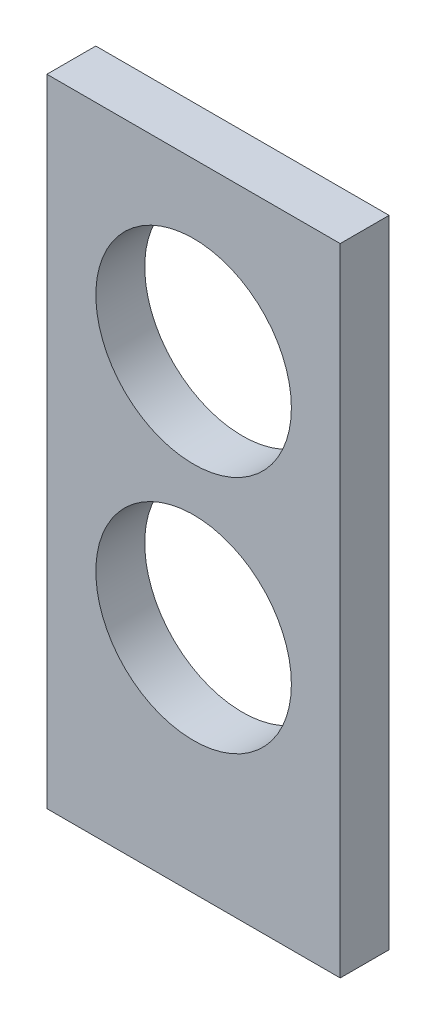
ISO-10303-21;
HEADER;
FILE_DESCRIPTION(('STEP AP214'),'2;1');
FILE_NAME('part.step','',(''),(''),'','','');
FILE_SCHEMA(('AUTOMOTIVE_DESIGN { 1 0 10303 214 1 1 1 1 }'));
ENDSEC;
DATA;
#1=APPLICATION_CONTEXT('core data for automotive mechanical design processes');
#2=APPLICATION_PROTOCOL_DEFINITION('international standard','automotive_design',2000,#1);
#3=PRODUCT_CONTEXT('',#1,'mechanical');
#4=PRODUCT('Part','Part','',(#3));
#5=PRODUCT_RELATED_PRODUCT_CATEGORY('part','',(#4));
#6=PRODUCT_DEFINITION_FORMATION('','',#4);
#7=PRODUCT_DEFINITION_CONTEXT('part definition',#1,'design');
#8=PRODUCT_DEFINITION('design','',#6,#7);
#9=PRODUCT_DEFINITION_SHAPE('','',#8);
#10=(LENGTH_UNIT() NAMED_UNIT(*) SI_UNIT(.MILLI.,.METRE.));
#11=(NAMED_UNIT(*) PLANE_ANGLE_UNIT() SI_UNIT($,.RADIAN.));
#12=(NAMED_UNIT(*) SI_UNIT($,.STERADIAN.) SOLID_ANGLE_UNIT());
#13=UNCERTAINTY_MEASURE_WITH_UNIT(LENGTH_MEASURE(1.E-05),#10,'distance_accuracy_value','');
#14=(GEOMETRIC_REPRESENTATION_CONTEXT(3) GLOBAL_UNCERTAINTY_ASSIGNED_CONTEXT((#13)) GLOBAL_UNIT_ASSIGNED_CONTEXT((#10,
#11,#12)) REPRESENTATION_CONTEXT('',''));
#15=CARTESIAN_POINT('',(0.,0.,0.));
#16=DIRECTION('',(0.,0.,1.));
#17=DIRECTION('',(1.,0.,0.));
#18=AXIS2_PLACEMENT_3D('',#15,#16,#17);
#19=CARTESIAN_POINT('',(0.,0.,5.));
#20=DIRECTION('',(0.,0.,-1.));
#21=DIRECTION('',(-1.,0.,0.));
#22=AXIS2_PLACEMENT_3D('',#19,#20,#21);
#23=PLANE('',#22);
#24=DIRECTION('',(1.,0.,0.));
#25=VECTOR('',#24,1.);
#26=CARTESIAN_POINT('',(-15.0054931684976,-40.5861330056473,5.));
#27=LINE('',#26,#25);
#28=CARTESIAN_POINT('',(-15.0054931684976,-40.5861330056473,5.));
#29=VERTEX_POINT('',#28);
#30=CARTESIAN_POINT('',(14.9945068315024,-40.5861330056473,5.));
#31=VERTEX_POINT('',#30);
#32=EDGE_CURVE('E85',#29,#31,#27,.T.);
#33=ORIENTED_EDGE('',*,*,#32,.T.);
#34=DIRECTION('',(0.,1.,0.));
#35=VECTOR('',#34,1.);
#36=CARTESIAN_POINT('',(14.9945068315024,24.4701594620561,5.));
#37=LINE('',#36,#35);
#38=CARTESIAN_POINT('',(14.9945068315024,24.4701594620561,5.));
#39=VERTEX_POINT('',#38);
#40=EDGE_CURVE('E80',#31,#39,#37,.T.);
#41=ORIENTED_EDGE('',*,*,#40,.T.);
#42=DIRECTION('',(-1.,0.,0.));
#43=VECTOR('',#42,1.);
#44=CARTESIAN_POINT('',(-15.0054931684976,24.4701594620561,5.));
#45=LINE('',#44,#43);
#46=CARTESIAN_POINT('',(-15.0054931684976,24.4701594620561,5.));
#47=VERTEX_POINT('',#46);
#48=EDGE_CURVE('E83',#39,#47,#45,.T.);
#49=ORIENTED_EDGE('',*,*,#48,.T.);
#50=DIRECTION('',(0.,-1.,0.));
#51=VECTOR('',#50,1.);
#52=CARTESIAN_POINT('',(-15.0054931684976,-40.5861330056473,5.));
#53=LINE('',#52,#51);
#54=EDGE_CURVE('E50',#47,#29,#53,.T.);
#55=ORIENTED_EDGE('',*,*,#54,.T.);
#56=EDGE_LOOP('',(#33,#41,#49,#55));
#57=FACE_BOUND('',#56,.T.);
#58=CARTESIAN_POINT('',(0.,7.4227519636605,5.));
#59=DIRECTION('',(0.,0.,1.));
#60=DIRECTION('',(1.,0.,0.));
#61=AXIS2_PLACEMENT_3D('',#58,#59,#60);
#62=CIRCLE('',#61,10.);
#63=CARTESIAN_POINT('',(10.,7.4227519636605,5.));
#64=VERTEX_POINT('',#63);
#65=EDGE_CURVE('E100',#64,#64,#62,.T.);
#66=ORIENTED_EDGE('',*,*,#65,.F.);
#67=EDGE_LOOP('',(#66));
#68=FACE_BOUND('',#67,.T.);
#69=CARTESIAN_POINT('',(0.,-17.0544659184068,5.));
#70=DIRECTION('',(0.,0.,1.));
#71=DIRECTION('',(1.,0.,0.));
#72=AXIS2_PLACEMENT_3D('',#69,#70,#71);
#73=CIRCLE('',#72,10.);
#74=CARTESIAN_POINT('',(9.99999999999999,-17.0544659184068,5.));
#75=VERTEX_POINT('',#74);
#76=EDGE_CURVE('E115',#75,#75,#73,.T.);
#77=ORIENTED_EDGE('',*,*,#76,.F.);
#78=EDGE_LOOP('',(#77));
#79=FACE_BOUND('',#78,.T.);
#80=ADVANCED_FACE('F33',(#57,#68,#79),#23,.F.);
#81=CARTESIAN_POINT('',(0.,0.,0.));
#82=DIRECTION('',(0.,0.,-1.));
#83=DIRECTION('',(-1.,0.,0.));
#84=AXIS2_PLACEMENT_3D('',#81,#82,#83);
#85=PLANE('',#84);
#86=CARTESIAN_POINT('',(0.,7.4227519636605,0.));
#87=DIRECTION('',(0.,0.,1.));
#88=DIRECTION('',(1.,0.,0.));
#89=AXIS2_PLACEMENT_3D('',#86,#87,#88);
#90=CIRCLE('',#89,10.);
#91=CARTESIAN_POINT('',(10.,7.4227519636605,0.));
#92=VERTEX_POINT('',#91);
#93=EDGE_CURVE('E112',#92,#92,#90,.T.);
#94=ORIENTED_EDGE('',*,*,#93,.T.);
#95=EDGE_LOOP('',(#94));
#96=FACE_BOUND('',#95,.T.);
#97=DIRECTION('',(1.,0.,0.));
#98=VECTOR('',#97,1.);
#99=CARTESIAN_POINT('',(-15.0054931684976,-40.5861330056473,0.));
#100=LINE('',#99,#98);
#101=CARTESIAN_POINT('',(-15.0054931684976,-40.5861330056473,0.));
#102=VERTEX_POINT('',#101);
#103=CARTESIAN_POINT('',(14.9945068315024,-40.5861330056473,0.));
#104=VERTEX_POINT('',#103);
#105=EDGE_CURVE('E97',#102,#104,#100,.T.);
#106=ORIENTED_EDGE('',*,*,#105,.F.);
#107=DIRECTION('',(0.,-1.,0.));
#108=VECTOR('',#107,1.);
#109=CARTESIAN_POINT('',(-15.0054931684976,-40.5861330056473,0.));
#110=LINE('',#109,#108);
#111=CARTESIAN_POINT('',(-15.0054931684976,24.4701594620561,0.));
#112=VERTEX_POINT('',#111);
#113=EDGE_CURVE('E73',#112,#102,#110,.T.);
#114=ORIENTED_EDGE('',*,*,#113,.F.);
#115=DIRECTION('',(-1.,0.,0.));
#116=VECTOR('',#115,1.);
#117=CARTESIAN_POINT('',(-15.0054931684976,24.4701594620561,0.));
#118=LINE('',#117,#116);
#119=CARTESIAN_POINT('',(14.9945068315024,24.4701594620561,0.));
#120=VERTEX_POINT('',#119);
#121=EDGE_CURVE('E67',#120,#112,#118,.T.);
#122=ORIENTED_EDGE('',*,*,#121,.F.);
#123=DIRECTION('',(0.,1.,0.));
#124=VECTOR('',#123,1.);
#125=CARTESIAN_POINT('',(14.9945068315024,24.4701594620561,0.));
#126=LINE('',#125,#124);
#127=EDGE_CURVE('E89',#104,#120,#126,.T.);
#128=ORIENTED_EDGE('',*,*,#127,.F.);
#129=EDGE_LOOP('',(#106,#114,#122,#128));
#130=FACE_BOUND('',#129,.T.);
#131=CARTESIAN_POINT('',(0.,-17.0544659184068,0.));
#132=DIRECTION('',(0.,0.,1.));
#133=DIRECTION('',(1.,0.,0.));
#134=AXIS2_PLACEMENT_3D('',#131,#132,#133);
#135=CIRCLE('',#134,10.);
#136=CARTESIAN_POINT('',(9.99999999999999,-17.0544659184068,0.));
#137=VERTEX_POINT('',#136);
#138=EDGE_CURVE('E118',#137,#137,#135,.T.);
#139=ORIENTED_EDGE('',*,*,#138,.T.);
#140=EDGE_LOOP('',(#139));
#141=FACE_BOUND('',#140,.T.);
#142=ADVANCED_FACE('F108',(#96,#130,#141),#85,.T.);
#143=CARTESIAN_POINT('',(-15.0054931684976,-40.5861330056473,5.));
#144=DIRECTION('',(0.,1.,0.));
#145=DIRECTION('',(0.,0.,1.));
#146=AXIS2_PLACEMENT_3D('',#143,#144,#145);
#147=PLANE('',#146);
#148=ORIENTED_EDGE('',*,*,#105,.T.);
#149=DIRECTION('',(0.,0.,-1.));
#150=VECTOR('',#149,1.);
#151=CARTESIAN_POINT('',(14.9945068315024,-40.5861330056473,5.));
#152=LINE('',#151,#150);
#153=EDGE_CURVE('E11',#31,#104,#152,.T.);
#154=ORIENTED_EDGE('',*,*,#153,.F.);
#155=ORIENTED_EDGE('',*,*,#32,.F.);
#156=DIRECTION('',(0.,0.,-1.));
#157=VECTOR('',#156,1.);
#158=CARTESIAN_POINT('',(-15.0054931684976,-40.5861330056473,5.));
#159=LINE('',#158,#157);
#160=EDGE_CURVE('E93',#29,#102,#159,.T.);
#161=ORIENTED_EDGE('',*,*,#160,.T.);
#162=EDGE_LOOP('',(#148,#154,#155,#161));
#163=FACE_BOUND('',#162,.T.);
#164=ADVANCED_FACE('F35',(#163),#147,.F.);
#165=CARTESIAN_POINT('',(14.9945068315024,24.4701594620561,5.));
#166=DIRECTION('',(-1.,0.,0.));
#167=DIRECTION('',(0.,-1.,0.));
#168=AXIS2_PLACEMENT_3D('',#165,#166,#167);
#169=PLANE('',#168);
#170=ORIENTED_EDGE('',*,*,#127,.T.);
#171=DIRECTION('',(0.,0.,-1.));
#172=VECTOR('',#171,1.);
#173=CARTESIAN_POINT('',(14.9945068315024,24.4701594620561,5.));
#174=LINE('',#173,#172);
#175=EDGE_CURVE('E42',#39,#120,#174,.T.);
#176=ORIENTED_EDGE('',*,*,#175,.F.);
#177=ORIENTED_EDGE('',*,*,#40,.F.);
#178=ORIENTED_EDGE('',*,*,#153,.T.);
#179=EDGE_LOOP('',(#170,#176,#177,#178));
#180=FACE_BOUND('',#179,.T.);
#181=ADVANCED_FACE('F88',(#180),#169,.F.);
#182=CARTESIAN_POINT('',(-15.0054931684976,24.4701594620561,5.));
#183=DIRECTION('',(0.,-1.,0.));
#184=DIRECTION('',(0.,0.,-1.));
#185=AXIS2_PLACEMENT_3D('',#182,#183,#184);
#186=PLANE('',#185);
#187=ORIENTED_EDGE('',*,*,#121,.T.);
#188=DIRECTION('',(0.,0.,-1.));
#189=VECTOR('',#188,1.);
#190=CARTESIAN_POINT('',(-15.0054931684976,24.4701594620561,5.));
#191=LINE('',#190,#189);
#192=EDGE_CURVE('E90',#47,#112,#191,.T.);
#193=ORIENTED_EDGE('',*,*,#192,.F.);
#194=ORIENTED_EDGE('',*,*,#48,.F.);
#195=ORIENTED_EDGE('',*,*,#175,.T.);
#196=EDGE_LOOP('',(#187,#193,#194,#195));
#197=FACE_BOUND('',#196,.T.);
#198=ADVANCED_FACE('F91',(#197),#186,.F.);
#199=CARTESIAN_POINT('',(-15.0054931684976,-40.5861330056473,5.));
#200=DIRECTION('',(1.,0.,0.));
#201=DIRECTION('',(0.,0.,-1.));
#202=AXIS2_PLACEMENT_3D('',#199,#200,#201);
#203=PLANE('',#202);
#204=ORIENTED_EDGE('',*,*,#113,.T.);
#205=ORIENTED_EDGE('',*,*,#160,.F.);
#206=ORIENTED_EDGE('',*,*,#54,.F.);
#207=ORIENTED_EDGE('',*,*,#192,.T.);
#208=EDGE_LOOP('',(#204,#205,#206,#207));
#209=FACE_BOUND('',#208,.T.);
#210=ADVANCED_FACE('F105',(#209),#203,.F.);
#211=CARTESIAN_POINT('',(0.,7.4227519636605,5.));
#212=DIRECTION('',(0.,0.,-1.));
#213=DIRECTION('',(-1.,0.,0.));
#214=AXIS2_PLACEMENT_3D('',#211,#212,#213);
#215=CYLINDRICAL_SURFACE('',#214,10.);
#216=ORIENTED_EDGE('',*,*,#65,.T.);
#217=EDGE_LOOP('',(#216));
#218=FACE_BOUND('',#217,.T.);
#219=ORIENTED_EDGE('',*,*,#93,.F.);
#220=EDGE_LOOP('',(#219));
#221=FACE_BOUND('',#220,.T.);
#222=ADVANCED_FACE('F135',(#218,#221),#215,.F.);
#223=CARTESIAN_POINT('',(0.,-17.0544659184068,5.));
#224=DIRECTION('',(0.,0.,-1.));
#225=DIRECTION('',(-1.,0.,0.));
#226=AXIS2_PLACEMENT_3D('',#223,#224,#225);
#227=CYLINDRICAL_SURFACE('',#226,10.);
#228=ORIENTED_EDGE('',*,*,#76,.T.);
#229=EDGE_LOOP('',(#228));
#230=FACE_BOUND('',#229,.T.);
#231=ORIENTED_EDGE('',*,*,#138,.F.);
#232=EDGE_LOOP('',(#231));
#233=FACE_BOUND('',#232,.T.);
#234=ADVANCED_FACE('F124',(#230,#233),#227,.F.);
#235=CLOSED_SHELL('',(#80,#142,#164,#181,#198,#210,#222,#234));
#236=MANIFOLD_SOLID_BREP('B2',#235);
#237=ADVANCED_BREP_SHAPE_REPRESENTATION('',(#18,#236),#14);
#238=SHAPE_DEFINITION_REPRESENTATION(#9,#237);
ENDSEC;
END-ISO-10303-21;
